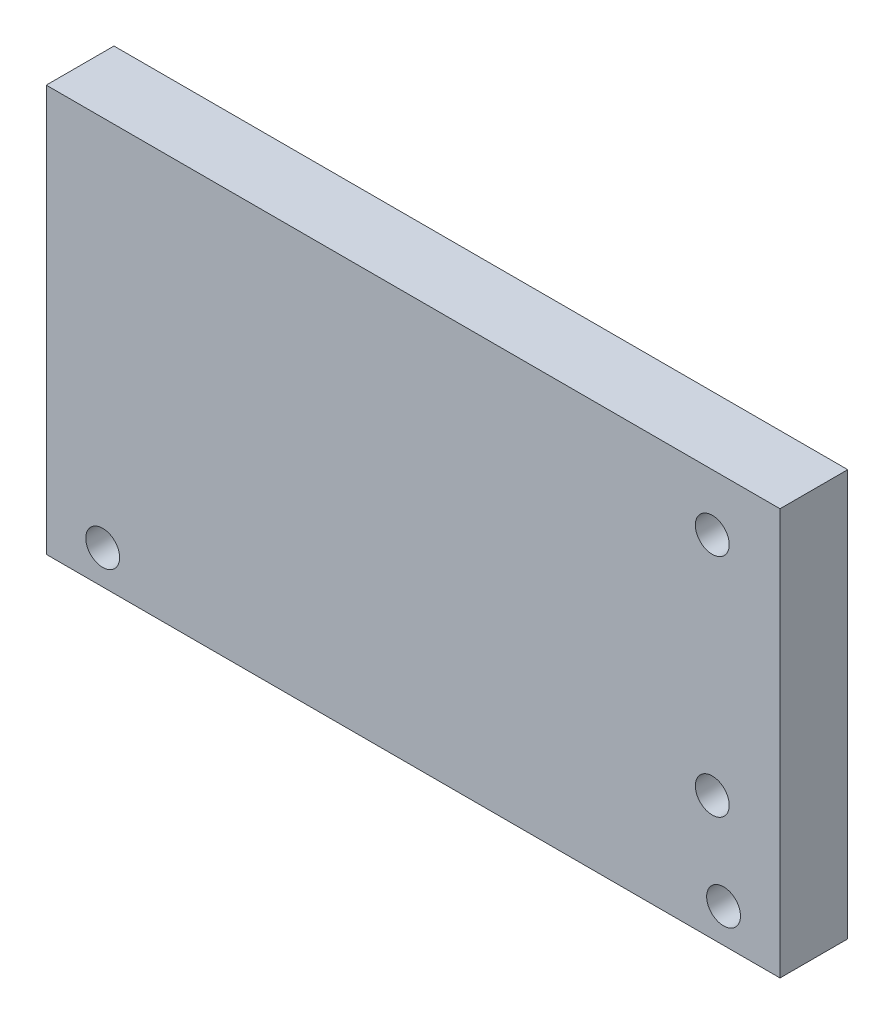
ISO-10303-21;
HEADER;
FILE_DESCRIPTION(('STEP AP214'),'2;1');
FILE_NAME('part.step','',(''),(''),'','','');
FILE_SCHEMA(('AUTOMOTIVE_DESIGN { 1 0 10303 214 1 1 1 1 }'));
ENDSEC;
DATA;
#1=APPLICATION_CONTEXT('core data for automotive mechanical design processes');
#2=APPLICATION_PROTOCOL_DEFINITION('international standard','automotive_design',2000,#1);
#3=PRODUCT_CONTEXT('',#1,'mechanical');
#4=PRODUCT('Part','Part','',(#3));
#5=PRODUCT_RELATED_PRODUCT_CATEGORY('part','',(#4));
#6=PRODUCT_DEFINITION_FORMATION('','',#4);
#7=PRODUCT_DEFINITION_CONTEXT('part definition',#1,'design');
#8=PRODUCT_DEFINITION('design','',#6,#7);
#9=PRODUCT_DEFINITION_SHAPE('','',#8);
#10=(LENGTH_UNIT() NAMED_UNIT(*) SI_UNIT(.MILLI.,.METRE.));
#11=(NAMED_UNIT(*) PLANE_ANGLE_UNIT() SI_UNIT($,.RADIAN.));
#12=(NAMED_UNIT(*) SI_UNIT($,.STERADIAN.) SOLID_ANGLE_UNIT());
#13=UNCERTAINTY_MEASURE_WITH_UNIT(LENGTH_MEASURE(1.E-05),#10,'distance_accuracy_value','');
#14=(GEOMETRIC_REPRESENTATION_CONTEXT(3) GLOBAL_UNCERTAINTY_ASSIGNED_CONTEXT((#13)) GLOBAL_UNIT_ASSIGNED_CONTEXT((#10,
#11,#12)) REPRESENTATION_CONTEXT('',''));
#15=CARTESIAN_POINT('',(0.,0.,0.));
#16=DIRECTION('',(0.,0.,1.));
#17=DIRECTION('',(1.,0.,0.));
#18=AXIS2_PLACEMENT_3D('',#15,#16,#17);
#19=CARTESIAN_POINT('',(0.,0.,6.));
#20=DIRECTION('',(0.,0.,1.));
#21=DIRECTION('',(1.,0.,0.));
#22=AXIS2_PLACEMENT_3D('',#19,#20,#21);
#23=PLANE('',#22);
#24=CARTESIAN_POINT('',(19.7287790550811,3.63194444444443,6.));
#25=DIRECTION('',(0.,0.,1.));
#26=DIRECTION('',(1.,0.,0.));
#27=AXIS2_PLACEMENT_3D('',#24,#25,#26);
#28=CIRCLE('',#27,1.5);
#29=CARTESIAN_POINT('',(21.2287790550811,3.63194444444443,6.));
#30=VERTEX_POINT('',#29);
#31=EDGE_CURVE('E122',#30,#30,#28,.T.);
#32=ORIENTED_EDGE('',*,*,#31,.F.);
#33=EDGE_LOOP('',(#32));
#34=FACE_BOUND('',#33,.T.);
#35=CARTESIAN_POINT('',(-35.2712209449189,3.63194444444444,6.));
#36=DIRECTION('',(0.,0.,1.));
#37=DIRECTION('',(1.,0.,0.));
#38=AXIS2_PLACEMENT_3D('',#35,#36,#37);
#39=CIRCLE('',#38,1.5);
#40=CARTESIAN_POINT('',(-33.7712209449189,3.63194444444444,6.));
#41=VERTEX_POINT('',#40);
#42=EDGE_CURVE('E111',#41,#41,#39,.T.);
#43=ORIENTED_EDGE('',*,*,#42,.F.);
#44=EDGE_LOOP('',(#43));
#45=FACE_BOUND('',#44,.T.);
#46=CARTESIAN_POINT('',(18.7287790550811,31.6319444444444,6.));
#47=DIRECTION('',(0.,0.,1.));
#48=DIRECTION('',(1.,0.,0.));
#49=AXIS2_PLACEMENT_3D('',#46,#47,#48);
#50=CIRCLE('',#49,1.5);
#51=CARTESIAN_POINT('',(20.2287790550811,31.6319444444444,6.));
#52=VERTEX_POINT('',#51);
#53=EDGE_CURVE('E103',#52,#52,#50,.T.);
#54=ORIENTED_EDGE('',*,*,#53,.F.);
#55=EDGE_LOOP('',(#54));
#56=FACE_BOUND('',#55,.T.);
#57=DIRECTION('',(0.,-1.,0.));
#58=VECTOR('',#57,1.);
#59=CARTESIAN_POINT('',(-40.2712209449189,36.6319444444444,6.));
#60=LINE('',#59,#58);
#61=CARTESIAN_POINT('',(-40.2712209449189,36.6319444444444,6.));
#62=VERTEX_POINT('',#61);
#63=CARTESIAN_POINT('',(-40.2712209449189,0.631944444444435,6.));
#64=VERTEX_POINT('',#63);
#65=EDGE_CURVE('E87',#62,#64,#60,.T.);
#66=ORIENTED_EDGE('',*,*,#65,.T.);
#67=DIRECTION('',(1.,0.,0.));
#68=VECTOR('',#67,1.);
#69=CARTESIAN_POINT('',(-40.2712209449189,0.631944444444435,6.));
#70=LINE('',#69,#68);
#71=CARTESIAN_POINT('',(24.7287790550811,0.631944444444435,6.));
#72=VERTEX_POINT('',#71);
#73=EDGE_CURVE('E82',#64,#72,#70,.T.);
#74=ORIENTED_EDGE('',*,*,#73,.T.);
#75=DIRECTION('',(0.,1.,0.));
#76=VECTOR('',#75,1.);
#77=CARTESIAN_POINT('',(24.7287790550811,36.6319444444444,6.));
#78=LINE('',#77,#76);
#79=CARTESIAN_POINT('',(24.7287790550811,36.6319444444444,6.));
#80=VERTEX_POINT('',#79);
#81=EDGE_CURVE('E85',#72,#80,#78,.T.);
#82=ORIENTED_EDGE('',*,*,#81,.T.);
#83=DIRECTION('',(-1.,0.,0.));
#84=VECTOR('',#83,1.);
#85=CARTESIAN_POINT('',(-40.2712209449189,36.6319444444444,6.));
#86=LINE('',#85,#84);
#87=EDGE_CURVE('E52',#80,#62,#86,.T.);
#88=ORIENTED_EDGE('',*,*,#87,.T.);
#89=EDGE_LOOP('',(#66,#74,#82,#88));
#90=FACE_BOUND('',#89,.T.);
#91=CARTESIAN_POINT('',(18.7287790550811,11.6319444444444,6.));
#92=DIRECTION('',(0.,0.,1.));
#93=DIRECTION('',(1.,0.,0.));
#94=AXIS2_PLACEMENT_3D('',#91,#92,#93);
#95=CIRCLE('',#94,1.5);
#96=CARTESIAN_POINT('',(20.2287790550811,11.6319444444444,6.));
#97=VERTEX_POINT('',#96);
#98=EDGE_CURVE('E115',#97,#97,#95,.T.);
#99=ORIENTED_EDGE('',*,*,#98,.F.);
#100=EDGE_LOOP('',(#99));
#101=FACE_BOUND('',#100,.T.);
#102=ADVANCED_FACE('F33',(#34,#45,#56,#90,#101),#23,.T.);
#103=CARTESIAN_POINT('',(0.,0.,0.));
#104=DIRECTION('',(0.,0.,1.));
#105=DIRECTION('',(1.,0.,0.));
#106=AXIS2_PLACEMENT_3D('',#103,#104,#105);
#107=PLANE('',#106);
#108=CARTESIAN_POINT('',(19.7287790550811,3.63194444444443,0.));
#109=DIRECTION('',(0.,0.,1.));
#110=DIRECTION('',(1.,0.,0.));
#111=AXIS2_PLACEMENT_3D('',#108,#109,#110);
#112=CIRCLE('',#111,1.5);
#113=CARTESIAN_POINT('',(21.2287790550811,3.63194444444443,0.));
#114=VERTEX_POINT('',#113);
#115=EDGE_CURVE('E37',#114,#114,#112,.T.);
#116=ORIENTED_EDGE('',*,*,#115,.T.);
#117=EDGE_LOOP('',(#116));
#118=FACE_BOUND('',#117,.T.);
#119=CARTESIAN_POINT('',(-35.2712209449189,3.63194444444444,0.));
#120=DIRECTION('',(0.,0.,1.));
#121=DIRECTION('',(1.,0.,0.));
#122=AXIS2_PLACEMENT_3D('',#119,#120,#121);
#123=CIRCLE('',#122,1.5);
#124=CARTESIAN_POINT('',(-33.7712209449189,3.63194444444444,0.));
#125=VERTEX_POINT('',#124);
#126=EDGE_CURVE('E108',#125,#125,#123,.T.);
#127=ORIENTED_EDGE('',*,*,#126,.T.);
#128=EDGE_LOOP('',(#127));
#129=FACE_BOUND('',#128,.T.);
#130=DIRECTION('',(0.,-1.,0.));
#131=VECTOR('',#130,1.);
#132=CARTESIAN_POINT('',(-40.2712209449189,36.6319444444444,0.));
#133=LINE('',#132,#131);
#134=CARTESIAN_POINT('',(-40.2712209449189,36.6319444444444,0.));
#135=VERTEX_POINT('',#134);
#136=CARTESIAN_POINT('',(-40.2712209449189,0.631944444444435,0.));
#137=VERTEX_POINT('',#136);
#138=EDGE_CURVE('E100',#135,#137,#133,.T.);
#139=ORIENTED_EDGE('',*,*,#138,.F.);
#140=DIRECTION('',(-1.,0.,0.));
#141=VECTOR('',#140,1.);
#142=CARTESIAN_POINT('',(-40.2712209449189,36.6319444444444,0.));
#143=LINE('',#142,#141);
#144=CARTESIAN_POINT('',(24.7287790550811,36.6319444444444,0.));
#145=VERTEX_POINT('',#144);
#146=EDGE_CURVE('E75',#145,#135,#143,.T.);
#147=ORIENTED_EDGE('',*,*,#146,.F.);
#148=DIRECTION('',(0.,1.,0.));
#149=VECTOR('',#148,1.);
#150=CARTESIAN_POINT('',(24.7287790550811,36.6319444444444,0.));
#151=LINE('',#150,#149);
#152=CARTESIAN_POINT('',(24.7287790550811,0.631944444444435,0.));
#153=VERTEX_POINT('',#152);
#154=EDGE_CURVE('E69',#153,#145,#151,.T.);
#155=ORIENTED_EDGE('',*,*,#154,.F.);
#156=DIRECTION('',(1.,0.,0.));
#157=VECTOR('',#156,1.);
#158=CARTESIAN_POINT('',(-40.2712209449189,0.631944444444435,0.));
#159=LINE('',#158,#157);
#160=EDGE_CURVE('E91',#137,#153,#159,.T.);
#161=ORIENTED_EDGE('',*,*,#160,.F.);
#162=EDGE_LOOP('',(#139,#147,#155,#161));
#163=FACE_BOUND('',#162,.T.);
#164=CARTESIAN_POINT('',(18.7287790550811,31.6319444444444,0.));
#165=DIRECTION('',(0.,0.,1.));
#166=DIRECTION('',(1.,0.,0.));
#167=AXIS2_PLACEMENT_3D('',#164,#165,#166);
#168=CIRCLE('',#167,1.5);
#169=CARTESIAN_POINT('',(20.2287790550811,31.6319444444444,0.));
#170=VERTEX_POINT('',#169);
#171=EDGE_CURVE('E126',#170,#170,#168,.T.);
#172=ORIENTED_EDGE('',*,*,#171,.T.);
#173=EDGE_LOOP('',(#172));
#174=FACE_BOUND('',#173,.T.);
#175=CARTESIAN_POINT('',(18.7287790550811,11.6319444444444,0.));
#176=DIRECTION('',(0.,0.,1.));
#177=DIRECTION('',(1.,0.,0.));
#178=AXIS2_PLACEMENT_3D('',#175,#176,#177);
#179=CIRCLE('',#178,1.5);
#180=CARTESIAN_POINT('',(20.2287790550811,11.6319444444444,0.));
#181=VERTEX_POINT('',#180);
#182=EDGE_CURVE('E110',#181,#181,#179,.T.);
#183=ORIENTED_EDGE('',*,*,#182,.T.);
#184=EDGE_LOOP('',(#183));
#185=FACE_BOUND('',#184,.T.);
#186=ADVANCED_FACE('F133',(#118,#129,#163,#174,#185),#107,.F.);
#187=CARTESIAN_POINT('',(-40.2712209449189,36.6319444444444,6.));
#188=DIRECTION('',(1.,0.,0.));
#189=DIRECTION('',(0.,1.,0.));
#190=AXIS2_PLACEMENT_3D('',#187,#188,#189);
#191=PLANE('',#190);
#192=ORIENTED_EDGE('',*,*,#138,.T.);
#193=DIRECTION('',(0.,0.,-1.));
#194=VECTOR('',#193,1.);
#195=CARTESIAN_POINT('',(-40.2712209449189,0.631944444444435,6.));
#196=LINE('',#195,#194);
#197=EDGE_CURVE('E11',#64,#137,#196,.T.);
#198=ORIENTED_EDGE('',*,*,#197,.F.);
#199=ORIENTED_EDGE('',*,*,#65,.F.);
#200=DIRECTION('',(0.,0.,-1.));
#201=VECTOR('',#200,1.);
#202=CARTESIAN_POINT('',(-40.2712209449189,36.6319444444444,6.));
#203=LINE('',#202,#201);
#204=EDGE_CURVE('E96',#62,#135,#203,.T.);
#205=ORIENTED_EDGE('',*,*,#204,.T.);
#206=EDGE_LOOP('',(#192,#198,#199,#205));
#207=FACE_BOUND('',#206,.T.);
#208=ADVANCED_FACE('F35',(#207),#191,.F.);
#209=CARTESIAN_POINT('',(-40.2712209449189,0.631944444444435,6.));
#210=DIRECTION('',(0.,1.,0.));
#211=DIRECTION('',(0.,0.,1.));
#212=AXIS2_PLACEMENT_3D('',#209,#210,#211);
#213=PLANE('',#212);
#214=ORIENTED_EDGE('',*,*,#160,.T.);
#215=DIRECTION('',(0.,0.,-1.));
#216=VECTOR('',#215,1.);
#217=CARTESIAN_POINT('',(24.7287790550811,0.631944444444435,6.));
#218=LINE('',#217,#216);
#219=EDGE_CURVE('E43',#72,#153,#218,.T.);
#220=ORIENTED_EDGE('',*,*,#219,.F.);
#221=ORIENTED_EDGE('',*,*,#73,.F.);
#222=ORIENTED_EDGE('',*,*,#197,.T.);
#223=EDGE_LOOP('',(#214,#220,#221,#222));
#224=FACE_BOUND('',#223,.T.);
#225=ADVANCED_FACE('F90',(#224),#213,.F.);
#226=CARTESIAN_POINT('',(24.7287790550811,36.6319444444444,6.));
#227=DIRECTION('',(-1.,0.,0.));
#228=DIRECTION('',(0.,-1.,0.));
#229=AXIS2_PLACEMENT_3D('',#226,#227,#228);
#230=PLANE('',#229);
#231=ORIENTED_EDGE('',*,*,#154,.T.);
#232=DIRECTION('',(0.,0.,-1.));
#233=VECTOR('',#232,1.);
#234=CARTESIAN_POINT('',(24.7287790550811,36.6319444444444,6.));
#235=LINE('',#234,#233);
#236=EDGE_CURVE('E92',#80,#145,#235,.T.);
#237=ORIENTED_EDGE('',*,*,#236,.F.);
#238=ORIENTED_EDGE('',*,*,#81,.F.);
#239=ORIENTED_EDGE('',*,*,#219,.T.);
#240=EDGE_LOOP('',(#231,#237,#238,#239));
#241=FACE_BOUND('',#240,.T.);
#242=ADVANCED_FACE('F94',(#241),#230,.F.);
#243=CARTESIAN_POINT('',(-40.2712209449189,36.6319444444444,6.));
#244=DIRECTION('',(0.,-1.,0.));
#245=DIRECTION('',(0.,0.,-1.));
#246=AXIS2_PLACEMENT_3D('',#243,#244,#245);
#247=PLANE('',#246);
#248=ORIENTED_EDGE('',*,*,#146,.T.);
#249=ORIENTED_EDGE('',*,*,#204,.F.);
#250=ORIENTED_EDGE('',*,*,#87,.F.);
#251=ORIENTED_EDGE('',*,*,#236,.T.);
#252=EDGE_LOOP('',(#248,#249,#250,#251));
#253=FACE_BOUND('',#252,.T.);
#254=ADVANCED_FACE('F139',(#253),#247,.F.);
#255=CARTESIAN_POINT('',(18.7287790550811,31.6319444444444,6.));
#256=DIRECTION('',(0.,0.,-1.));
#257=DIRECTION('',(-1.,0.,0.));
#258=AXIS2_PLACEMENT_3D('',#255,#256,#257);
#259=CYLINDRICAL_SURFACE('',#258,1.5);
#260=ORIENTED_EDGE('',*,*,#53,.T.);
#261=EDGE_LOOP('',(#260));
#262=FACE_BOUND('',#261,.T.);
#263=ORIENTED_EDGE('',*,*,#171,.F.);
#264=EDGE_LOOP('',(#263));
#265=FACE_BOUND('',#264,.T.);
#266=ADVANCED_FACE('F136',(#262,#265),#259,.F.);
#267=CARTESIAN_POINT('',(18.7287790550811,11.6319444444444,6.));
#268=DIRECTION('',(0.,0.,-1.));
#269=DIRECTION('',(-1.,0.,0.));
#270=AXIS2_PLACEMENT_3D('',#267,#268,#269);
#271=CYLINDRICAL_SURFACE('',#270,1.5);
#272=ORIENTED_EDGE('',*,*,#98,.T.);
#273=EDGE_LOOP('',(#272));
#274=FACE_BOUND('',#273,.T.);
#275=ORIENTED_EDGE('',*,*,#182,.F.);
#276=EDGE_LOOP('',(#275));
#277=FACE_BOUND('',#276,.T.);
#278=ADVANCED_FACE('F138',(#274,#277),#271,.F.);
#279=CARTESIAN_POINT('',(-35.2712209449189,3.63194444444444,-4.));
#280=DIRECTION('',(0.,0.,1.));
#281=DIRECTION('',(1.,0.,0.));
#282=AXIS2_PLACEMENT_3D('',#279,#280,#281);
#283=CYLINDRICAL_SURFACE('',#282,1.5);
#284=ORIENTED_EDGE('',*,*,#42,.T.);
#285=EDGE_LOOP('',(#284));
#286=FACE_BOUND('',#285,.T.);
#287=ORIENTED_EDGE('',*,*,#126,.F.);
#288=EDGE_LOOP('',(#287));
#289=FACE_BOUND('',#288,.T.);
#290=ADVANCED_FACE('F146',(#286,#289),#283,.F.);
#291=CARTESIAN_POINT('',(19.7287790550811,3.63194444444443,-4.));
#292=DIRECTION('',(0.,0.,1.));
#293=DIRECTION('',(1.,0.,0.));
#294=AXIS2_PLACEMENT_3D('',#291,#292,#293);
#295=CYLINDRICAL_SURFACE('',#294,1.5);
#296=ORIENTED_EDGE('',*,*,#31,.T.);
#297=EDGE_LOOP('',(#296));
#298=FACE_BOUND('',#297,.T.);
#299=ORIENTED_EDGE('',*,*,#115,.F.);
#300=EDGE_LOOP('',(#299));
#301=FACE_BOUND('',#300,.T.);
#302=ADVANCED_FACE('F187',(#298,#301),#295,.F.);
#303=CLOSED_SHELL('',(#102,#186,#208,#225,#242,#254,#266,#278,#290,#302));
#304=MANIFOLD_SOLID_BREP('B2',#303);
#305=ADVANCED_BREP_SHAPE_REPRESENTATION('',(#18,#304),#14);
#306=SHAPE_DEFINITION_REPRESENTATION(#9,#305);
ENDSEC;
END-ISO-10303-21;
